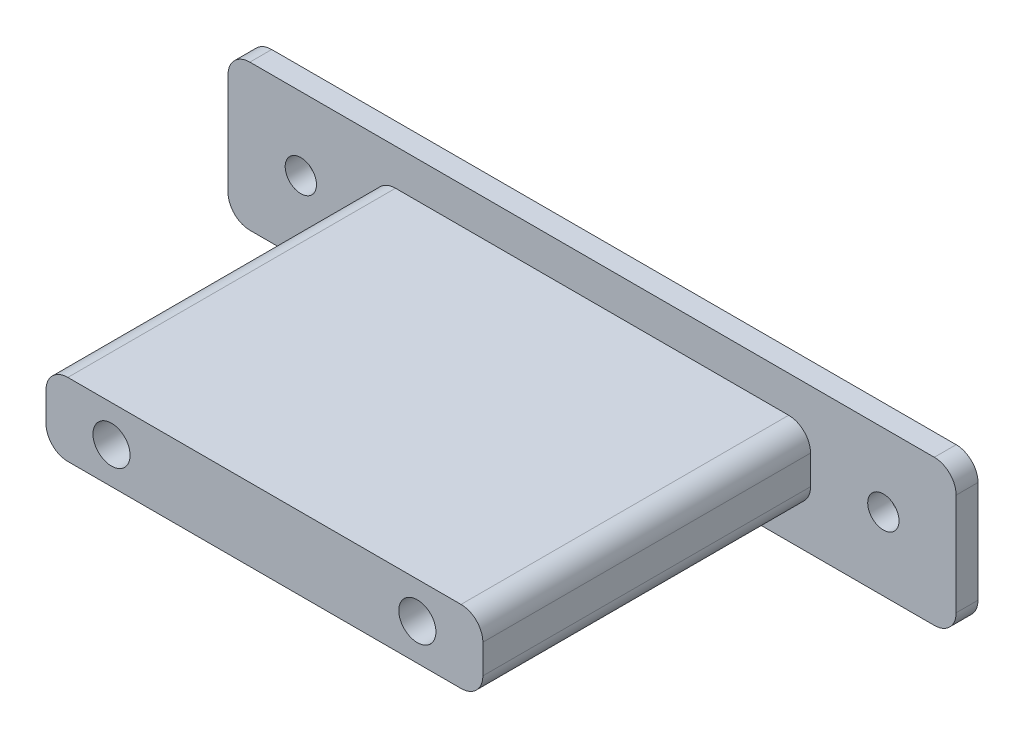
ISO-10303-21;
HEADER;
FILE_DESCRIPTION(('STEP AP214'),'2;1');
FILE_NAME('part.step','',(''),(''),'','','');
FILE_SCHEMA(('AUTOMOTIVE_DESIGN { 1 0 10303 214 1 1 1 1 }'));
ENDSEC;
DATA;
#1=APPLICATION_CONTEXT('core data for automotive mechanical design processes');
#2=APPLICATION_PROTOCOL_DEFINITION('international standard','automotive_design',2000,#1);
#3=PRODUCT_CONTEXT('',#1,'mechanical');
#4=PRODUCT('Part','Part','',(#3));
#5=PRODUCT_RELATED_PRODUCT_CATEGORY('part','',(#4));
#6=PRODUCT_DEFINITION_FORMATION('','',#4);
#7=PRODUCT_DEFINITION_CONTEXT('part definition',#1,'design');
#8=PRODUCT_DEFINITION('design','',#6,#7);
#9=PRODUCT_DEFINITION_SHAPE('','',#8);
#10=(LENGTH_UNIT() NAMED_UNIT(*) SI_UNIT(.MILLI.,.METRE.));
#11=(NAMED_UNIT(*) PLANE_ANGLE_UNIT() SI_UNIT($,.RADIAN.));
#12=(NAMED_UNIT(*) SI_UNIT($,.STERADIAN.) SOLID_ANGLE_UNIT());
#13=UNCERTAINTY_MEASURE_WITH_UNIT(LENGTH_MEASURE(1.E-05),#10,'distance_accuracy_value','');
#14=(GEOMETRIC_REPRESENTATION_CONTEXT(3) GLOBAL_UNCERTAINTY_ASSIGNED_CONTEXT((#13)) GLOBAL_UNIT_ASSIGNED_CONTEXT((#10,
#11,#12)) REPRESENTATION_CONTEXT('',''));
#15=CARTESIAN_POINT('',(0.,0.,0.));
#16=DIRECTION('',(0.,0.,1.));
#17=DIRECTION('',(1.,0.,0.));
#18=AXIS2_PLACEMENT_3D('',#15,#16,#17);
#19=CARTESIAN_POINT('',(0.,0.,3.));
#20=DIRECTION('',(0.,0.,1.));
#21=DIRECTION('',(1.,0.,0.));
#22=AXIS2_PLACEMENT_3D('',#19,#20,#21);
#23=PLANE('',#22);
#24=DIRECTION('',(1.,0.,0.));
#25=VECTOR('',#24,1.);
#26=CARTESIAN_POINT('',(0.,-5.,3.));
#27=LINE('',#26,#25);
#28=CARTESIAN_POINT('',(23.,-5.,3.));
#29=VERTEX_POINT('',#28);
#30=CARTESIAN_POINT('',(77.,-5.,3.));
#31=VERTEX_POINT('',#30);
#32=EDGE_CURVE('E255',#29,#31,#27,.T.);
#33=ORIENTED_EDGE('',*,*,#32,.T.);
#34=CARTESIAN_POINT('',(77.,-8.,3.));
#35=DIRECTION('',(0.,0.,1.));
#36=DIRECTION('',(1.,0.,0.));
#37=AXIS2_PLACEMENT_3D('',#34,#35,#36);
#38=CIRCLE('',#37,3.);
#39=CARTESIAN_POINT('',(80.,-8.,3.));
#40=VERTEX_POINT('',#39);
#41=EDGE_CURVE('E247',#31,#40,#38,.F.);
#42=ORIENTED_EDGE('',*,*,#41,.T.);
#43=DIRECTION('',(0.,-1.,0.));
#44=VECTOR('',#43,1.);
#45=CARTESIAN_POINT('',(80.,0.,3.));
#46=LINE('',#45,#44);
#47=CARTESIAN_POINT('',(80.,-12.,3.));
#48=VERTEX_POINT('',#47);
#49=EDGE_CURVE('E266',#40,#48,#46,.T.);
#50=ORIENTED_EDGE('',*,*,#49,.T.);
#51=CARTESIAN_POINT('',(77.,-12.,3.));
#52=DIRECTION('',(0.,0.,1.));
#53=DIRECTION('',(1.,0.,0.));
#54=AXIS2_PLACEMENT_3D('',#51,#52,#53);
#55=CIRCLE('',#54,3.);
#56=CARTESIAN_POINT('',(77.,-15.,3.));
#57=VERTEX_POINT('',#56);
#58=EDGE_CURVE('E249',#48,#57,#55,.F.);
#59=ORIENTED_EDGE('',*,*,#58,.T.);
#60=DIRECTION('',(1.,0.,0.));
#61=VECTOR('',#60,1.);
#62=CARTESIAN_POINT('',(0.,-15.,3.));
#63=LINE('',#62,#61);
#64=CARTESIAN_POINT('',(23.,-15.,3.));
#65=VERTEX_POINT('',#64);
#66=EDGE_CURVE('E290',#65,#57,#63,.T.);
#67=ORIENTED_EDGE('',*,*,#66,.F.);
#68=CARTESIAN_POINT('',(23.,-12.,3.));
#69=DIRECTION('',(0.,0.,1.));
#70=DIRECTION('',(1.,0.,0.));
#71=AXIS2_PLACEMENT_3D('',#68,#69,#70);
#72=CIRCLE('',#71,3.);
#73=CARTESIAN_POINT('',(20.,-12.,3.));
#74=VERTEX_POINT('',#73);
#75=EDGE_CURVE('E11',#65,#74,#72,.F.);
#76=ORIENTED_EDGE('',*,*,#75,.T.);
#77=DIRECTION('',(0.,-1.,0.));
#78=VECTOR('',#77,1.);
#79=CARTESIAN_POINT('',(20.,0.,3.));
#80=LINE('',#79,#78);
#81=CARTESIAN_POINT('',(20.,-8.,3.));
#82=VERTEX_POINT('',#81);
#83=EDGE_CURVE('E257',#82,#74,#80,.T.);
#84=ORIENTED_EDGE('',*,*,#83,.F.);
#85=CARTESIAN_POINT('',(23.,-8.,3.));
#86=DIRECTION('',(0.,0.,1.));
#87=DIRECTION('',(1.,0.,0.));
#88=AXIS2_PLACEMENT_3D('',#85,#86,#87);
#89=CIRCLE('',#88,3.);
#90=EDGE_CURVE('E45',#82,#29,#89,.F.);
#91=ORIENTED_EDGE('',*,*,#90,.T.);
#92=EDGE_LOOP('',(#33,#42,#50,#59,#67,#76,#84,#91));
#93=FACE_BOUND('',#92,.T.);
#94=CARTESIAN_POINT('',(10.,-10.,3.));
#95=DIRECTION('',(0.,0.,1.));
#96=DIRECTION('',(1.,0.,0.));
#97=AXIS2_PLACEMENT_3D('',#94,#95,#96);
#98=CIRCLE('',#97,2.15);
#99=CARTESIAN_POINT('',(12.15,-10.,3.));
#100=VERTEX_POINT('',#99);
#101=EDGE_CURVE('E179',#100,#100,#98,.T.);
#102=ORIENTED_EDGE('',*,*,#101,.F.);
#103=EDGE_LOOP('',(#102));
#104=FACE_BOUND('',#103,.T.);
#105=DIRECTION('',(-1.,0.,0.));
#106=VECTOR('',#105,1.);
#107=CARTESIAN_POINT('',(0.,0.,3.));
#108=LINE('',#107,#106);
#109=CARTESIAN_POINT('',(97.,0.,3.));
#110=VERTEX_POINT('',#109);
#111=CARTESIAN_POINT('',(3.,0.,3.));
#112=VERTEX_POINT('',#111);
#113=EDGE_CURVE('E188',#110,#112,#108,.T.);
#114=ORIENTED_EDGE('',*,*,#113,.T.);
#115=CARTESIAN_POINT('',(3.,-3.,3.));
#116=DIRECTION('',(0.,0.,1.));
#117=DIRECTION('',(1.,0.,0.));
#118=AXIS2_PLACEMENT_3D('',#115,#116,#117);
#119=CIRCLE('',#118,3.);
#120=CARTESIAN_POINT('',(0.,-3.,3.));
#121=VERTEX_POINT('',#120);
#122=EDGE_CURVE('E209',#112,#121,#119,.T.);
#123=ORIENTED_EDGE('',*,*,#122,.T.);
#124=DIRECTION('',(0.,-1.,0.));
#125=VECTOR('',#124,1.);
#126=CARTESIAN_POINT('',(0.,0.,3.));
#127=LINE('',#126,#125);
#128=CARTESIAN_POINT('',(0.,-17.,3.));
#129=VERTEX_POINT('',#128);
#130=EDGE_CURVE('E171',#121,#129,#127,.T.);
#131=ORIENTED_EDGE('',*,*,#130,.T.);
#132=CARTESIAN_POINT('',(3.,-17.,3.));
#133=DIRECTION('',(0.,0.,1.));
#134=DIRECTION('',(1.,0.,0.));
#135=AXIS2_PLACEMENT_3D('',#132,#133,#134);
#136=CIRCLE('',#135,3.);
#137=CARTESIAN_POINT('',(3.,-20.,3.));
#138=VERTEX_POINT('',#137);
#139=EDGE_CURVE('E203',#129,#138,#136,.T.);
#140=ORIENTED_EDGE('',*,*,#139,.T.);
#141=DIRECTION('',(1.,0.,0.));
#142=VECTOR('',#141,1.);
#143=CARTESIAN_POINT('',(0.,-20.,3.));
#144=LINE('',#143,#142);
#145=CARTESIAN_POINT('',(97.,-20.,3.));
#146=VERTEX_POINT('',#145);
#147=EDGE_CURVE('E300',#138,#146,#144,.T.);
#148=ORIENTED_EDGE('',*,*,#147,.T.);
#149=CARTESIAN_POINT('',(97.,-17.,3.));
#150=DIRECTION('',(0.,0.,1.));
#151=DIRECTION('',(1.,0.,0.));
#152=AXIS2_PLACEMENT_3D('',#149,#150,#151);
#153=CIRCLE('',#152,3.);
#154=CARTESIAN_POINT('',(100.,-17.,3.));
#155=VERTEX_POINT('',#154);
#156=EDGE_CURVE('E205',#146,#155,#153,.T.);
#157=ORIENTED_EDGE('',*,*,#156,.T.);
#158=DIRECTION('',(0.,1.,0.));
#159=VECTOR('',#158,1.);
#160=CARTESIAN_POINT('',(100.,0.,3.));
#161=LINE('',#160,#159);
#162=CARTESIAN_POINT('',(100.,-3.,3.));
#163=VERTEX_POINT('',#162);
#164=EDGE_CURVE('E302',#155,#163,#161,.T.);
#165=ORIENTED_EDGE('',*,*,#164,.T.);
#166=CARTESIAN_POINT('',(97.,-3.,3.));
#167=DIRECTION('',(0.,0.,1.));
#168=DIRECTION('',(1.,0.,0.));
#169=AXIS2_PLACEMENT_3D('',#166,#167,#168);
#170=CIRCLE('',#169,3.);
#171=EDGE_CURVE('E207',#163,#110,#170,.T.);
#172=ORIENTED_EDGE('',*,*,#171,.T.);
#173=EDGE_LOOP('',(#114,#123,#131,#140,#148,#157,#165,#172));
#174=FACE_BOUND('',#173,.T.);
#175=CARTESIAN_POINT('',(90.,-10.,3.));
#176=DIRECTION('',(0.,0.,1.));
#177=DIRECTION('',(-1.,0.,0.));
#178=AXIS2_PLACEMENT_3D('',#175,#176,#177);
#179=CIRCLE('',#178,2.15);
#180=CARTESIAN_POINT('',(87.85,-10.,3.));
#181=VERTEX_POINT('',#180);
#182=EDGE_CURVE('E292',#181,#181,#179,.T.);
#183=ORIENTED_EDGE('',*,*,#182,.F.);
#184=EDGE_LOOP('',(#183));
#185=FACE_BOUND('',#184,.T.);
#186=ADVANCED_FACE('F37',(#93,#104,#174,#185),#23,.T.);
#187=CARTESIAN_POINT('',(0.,0.,0.));
#188=DIRECTION('',(0.,0.,1.));
#189=DIRECTION('',(1.,0.,0.));
#190=AXIS2_PLACEMENT_3D('',#187,#188,#189);
#191=PLANE('',#190);
#192=DIRECTION('',(0.,-1.,0.));
#193=VECTOR('',#192,1.);
#194=CARTESIAN_POINT('',(0.,0.,0.));
#195=LINE('',#194,#193);
#196=CARTESIAN_POINT('',(0.,-3.,0.));
#197=VERTEX_POINT('',#196);
#198=CARTESIAN_POINT('',(0.,-17.,0.));
#199=VERTEX_POINT('',#198);
#200=EDGE_CURVE('E168',#197,#199,#195,.T.);
#201=ORIENTED_EDGE('',*,*,#200,.F.);
#202=CARTESIAN_POINT('',(3.,-3.,0.));
#203=DIRECTION('',(0.,0.,1.));
#204=DIRECTION('',(1.,0.,0.));
#205=AXIS2_PLACEMENT_3D('',#202,#203,#204);
#206=CIRCLE('',#205,3.);
#207=CARTESIAN_POINT('',(3.,0.,0.));
#208=VERTEX_POINT('',#207);
#209=EDGE_CURVE('E151',#197,#208,#206,.F.);
#210=ORIENTED_EDGE('',*,*,#209,.T.);
#211=DIRECTION('',(-1.,0.,0.));
#212=VECTOR('',#211,1.);
#213=CARTESIAN_POINT('',(0.,0.,0.));
#214=LINE('',#213,#212);
#215=CARTESIAN_POINT('',(97.,0.,0.));
#216=VERTEX_POINT('',#215);
#217=EDGE_CURVE('E193',#216,#208,#214,.T.);
#218=ORIENTED_EDGE('',*,*,#217,.F.);
#219=CARTESIAN_POINT('',(97.,-3.,0.));
#220=DIRECTION('',(0.,0.,1.));
#221=DIRECTION('',(1.,0.,0.));
#222=AXIS2_PLACEMENT_3D('',#219,#220,#221);
#223=CIRCLE('',#222,3.);
#224=CARTESIAN_POINT('',(100.,-3.,0.));
#225=VERTEX_POINT('',#224);
#226=EDGE_CURVE('E162',#216,#225,#223,.F.);
#227=ORIENTED_EDGE('',*,*,#226,.T.);
#228=DIRECTION('',(0.,1.,0.));
#229=VECTOR('',#228,1.);
#230=CARTESIAN_POINT('',(100.,0.,0.));
#231=LINE('',#230,#229);
#232=CARTESIAN_POINT('',(100.,-17.,0.));
#233=VERTEX_POINT('',#232);
#234=EDGE_CURVE('E182',#233,#225,#231,.T.);
#235=ORIENTED_EDGE('',*,*,#234,.F.);
#236=CARTESIAN_POINT('',(97.,-17.,0.));
#237=DIRECTION('',(0.,0.,1.));
#238=DIRECTION('',(1.,0.,0.));
#239=AXIS2_PLACEMENT_3D('',#236,#237,#238);
#240=CIRCLE('',#239,3.);
#241=CARTESIAN_POINT('',(97.,-20.,0.));
#242=VERTEX_POINT('',#241);
#243=EDGE_CURVE('E197',#233,#242,#240,.F.);
#244=ORIENTED_EDGE('',*,*,#243,.T.);
#245=DIRECTION('',(1.,0.,0.));
#246=VECTOR('',#245,1.);
#247=CARTESIAN_POINT('',(0.,-20.,0.));
#248=LINE('',#247,#246);
#249=CARTESIAN_POINT('',(3.,-20.,0.));
#250=VERTEX_POINT('',#249);
#251=EDGE_CURVE('E178',#250,#242,#248,.T.);
#252=ORIENTED_EDGE('',*,*,#251,.F.);
#253=CARTESIAN_POINT('',(3.,-17.,0.));
#254=DIRECTION('',(0.,0.,1.));
#255=DIRECTION('',(1.,0.,0.));
#256=AXIS2_PLACEMENT_3D('',#253,#254,#255);
#257=CIRCLE('',#256,3.);
#258=EDGE_CURVE('E172',#250,#199,#257,.F.);
#259=ORIENTED_EDGE('',*,*,#258,.T.);
#260=EDGE_LOOP('',(#201,#210,#218,#227,#235,#244,#252,#259));
#261=FACE_BOUND('',#260,.T.);
#262=CARTESIAN_POINT('',(10.,-10.,0.));
#263=DIRECTION('',(0.,0.,1.));
#264=DIRECTION('',(1.,0.,0.));
#265=AXIS2_PLACEMENT_3D('',#262,#263,#264);
#266=CIRCLE('',#265,2.15);
#267=CARTESIAN_POINT('',(12.15,-10.,0.));
#268=VERTEX_POINT('',#267);
#269=EDGE_CURVE('E185',#268,#268,#266,.T.);
#270=ORIENTED_EDGE('',*,*,#269,.T.);
#271=EDGE_LOOP('',(#270));
#272=FACE_BOUND('',#271,.T.);
#273=CARTESIAN_POINT('',(90.,-10.,0.));
#274=DIRECTION('',(0.,0.,1.));
#275=DIRECTION('',(-1.,0.,0.));
#276=AXIS2_PLACEMENT_3D('',#273,#274,#275);
#277=CIRCLE('',#276,2.15);
#278=CARTESIAN_POINT('',(87.85,-10.,0.));
#279=VERTEX_POINT('',#278);
#280=EDGE_CURVE('E280',#279,#279,#277,.T.);
#281=ORIENTED_EDGE('',*,*,#280,.T.);
#282=EDGE_LOOP('',(#281));
#283=FACE_BOUND('',#282,.T.);
#284=ADVANCED_FACE('F175',(#261,#272,#283),#191,.F.);
#285=CARTESIAN_POINT('',(0.,0.,3.));
#286=DIRECTION('',(1.,0.,0.));
#287=DIRECTION('',(0.,1.,0.));
#288=AXIS2_PLACEMENT_3D('',#285,#286,#287);
#289=PLANE('',#288);
#290=ORIENTED_EDGE('',*,*,#130,.F.);
#291=DIRECTION('',(0.,0.,-1.));
#292=VECTOR('',#291,1.);
#293=CARTESIAN_POINT('',(0.,-3.,3.));
#294=LINE('',#293,#292);
#295=EDGE_CURVE('E155',#121,#197,#294,.T.);
#296=ORIENTED_EDGE('',*,*,#295,.T.);
#297=ORIENTED_EDGE('',*,*,#200,.T.);
#298=DIRECTION('',(0.,0.,-1.));
#299=VECTOR('',#298,1.);
#300=CARTESIAN_POINT('',(0.,-17.,3.));
#301=LINE('',#300,#299);
#302=EDGE_CURVE('E173',#199,#129,#301,.F.);
#303=ORIENTED_EDGE('',*,*,#302,.T.);
#304=EDGE_LOOP('',(#290,#296,#297,#303));
#305=FACE_BOUND('',#304,.T.);
#306=ADVANCED_FACE('F167',(#305),#289,.F.);
#307=CARTESIAN_POINT('',(0.,-20.,3.));
#308=DIRECTION('',(0.,1.,0.));
#309=DIRECTION('',(0.,0.,1.));
#310=AXIS2_PLACEMENT_3D('',#307,#308,#309);
#311=PLANE('',#310);
#312=ORIENTED_EDGE('',*,*,#251,.T.);
#313=DIRECTION('',(0.,0.,-1.));
#314=VECTOR('',#313,1.);
#315=CARTESIAN_POINT('',(97.,-20.,3.));
#316=LINE('',#315,#314);
#317=EDGE_CURVE('E219',#242,#146,#316,.F.);
#318=ORIENTED_EDGE('',*,*,#317,.T.);
#319=ORIENTED_EDGE('',*,*,#147,.F.);
#320=DIRECTION('',(0.,0.,-1.));
#321=VECTOR('',#320,1.);
#322=CARTESIAN_POINT('',(3.,-20.,3.));
#323=LINE('',#322,#321);
#324=EDGE_CURVE('E216',#138,#250,#323,.T.);
#325=ORIENTED_EDGE('',*,*,#324,.T.);
#326=EDGE_LOOP('',(#312,#318,#319,#325));
#327=FACE_BOUND('',#326,.T.);
#328=ADVANCED_FACE('F325',(#327),#311,.F.);
#329=CARTESIAN_POINT('',(100.,0.,3.));
#330=DIRECTION('',(-1.,0.,0.));
#331=DIRECTION('',(0.,0.,1.));
#332=AXIS2_PLACEMENT_3D('',#329,#330,#331);
#333=PLANE('',#332);
#334=ORIENTED_EDGE('',*,*,#234,.T.);
#335=DIRECTION('',(0.,0.,-1.));
#336=VECTOR('',#335,1.);
#337=CARTESIAN_POINT('',(100.,-3.,3.));
#338=LINE('',#337,#336);
#339=EDGE_CURVE('E214',#225,#163,#338,.F.);
#340=ORIENTED_EDGE('',*,*,#339,.T.);
#341=ORIENTED_EDGE('',*,*,#164,.F.);
#342=DIRECTION('',(0.,0.,-1.));
#343=VECTOR('',#342,1.);
#344=CARTESIAN_POINT('',(100.,-17.,3.));
#345=LINE('',#344,#343);
#346=EDGE_CURVE('E211',#155,#233,#345,.T.);
#347=ORIENTED_EDGE('',*,*,#346,.T.);
#348=EDGE_LOOP('',(#334,#340,#341,#347));
#349=FACE_BOUND('',#348,.T.);
#350=ADVANCED_FACE('F318',(#349),#333,.F.);
#351=CARTESIAN_POINT('',(0.,0.,3.));
#352=DIRECTION('',(0.,-1.,0.));
#353=DIRECTION('',(0.,0.,-1.));
#354=AXIS2_PLACEMENT_3D('',#351,#352,#353);
#355=PLANE('',#354);
#356=ORIENTED_EDGE('',*,*,#217,.T.);
#357=DIRECTION('',(0.,0.,-1.));
#358=VECTOR('',#357,1.);
#359=CARTESIAN_POINT('',(3.,0.,3.));
#360=LINE('',#359,#358);
#361=EDGE_CURVE('E156',#208,#112,#360,.F.);
#362=ORIENTED_EDGE('',*,*,#361,.T.);
#363=ORIENTED_EDGE('',*,*,#113,.F.);
#364=DIRECTION('',(0.,0.,-1.));
#365=VECTOR('',#364,1.);
#366=CARTESIAN_POINT('',(97.,0.,3.));
#367=LINE('',#366,#365);
#368=EDGE_CURVE('E161',#110,#216,#367,.T.);
#369=ORIENTED_EDGE('',*,*,#368,.T.);
#370=EDGE_LOOP('',(#356,#362,#363,#369));
#371=FACE_BOUND('',#370,.T.);
#372=ADVANCED_FACE('F312',(#371),#355,.F.);
#373=CARTESIAN_POINT('',(10.,-10.,3.));
#374=DIRECTION('',(0.,0.,-1.));
#375=DIRECTION('',(-1.,0.,0.));
#376=AXIS2_PLACEMENT_3D('',#373,#374,#375);
#377=CYLINDRICAL_SURFACE('',#376,2.15);
#378=ORIENTED_EDGE('',*,*,#101,.T.);
#379=EDGE_LOOP('',(#378));
#380=FACE_BOUND('',#379,.T.);
#381=ORIENTED_EDGE('',*,*,#269,.F.);
#382=EDGE_LOOP('',(#381));
#383=FACE_BOUND('',#382,.T.);
#384=ADVANCED_FACE('F349',(#380,#383),#377,.F.);
#385=CARTESIAN_POINT('',(90.,-10.,3.));
#386=DIRECTION('',(0.,0.,-1.));
#387=DIRECTION('',(-1.,0.,0.));
#388=AXIS2_PLACEMENT_3D('',#385,#386,#387);
#389=CYLINDRICAL_SURFACE('',#388,2.15);
#390=ORIENTED_EDGE('',*,*,#182,.T.);
#391=EDGE_LOOP('',(#390));
#392=FACE_BOUND('',#391,.T.);
#393=ORIENTED_EDGE('',*,*,#280,.F.);
#394=EDGE_LOOP('',(#393));
#395=FACE_BOUND('',#394,.T.);
#396=ADVANCED_FACE('F467',(#392,#395),#389,.F.);
#397=CARTESIAN_POINT('',(80.,0.,48.));
#398=DIRECTION('',(1.,0.,0.));
#399=DIRECTION('',(0.,0.,-1.));
#400=AXIS2_PLACEMENT_3D('',#397,#398,#399);
#401=PLANE('',#400);
#402=ORIENTED_EDGE('',*,*,#49,.F.);
#403=DIRECTION('',(0.,0.,-1.));
#404=VECTOR('',#403,1.);
#405=CARTESIAN_POINT('',(80.,-8.,48.));
#406=LINE('',#405,#404);
#407=CARTESIAN_POINT('',(80.,-8.,48.));
#408=VERTEX_POINT('',#407);
#409=EDGE_CURVE('E229',#40,#408,#406,.F.);
#410=ORIENTED_EDGE('',*,*,#409,.T.);
#411=DIRECTION('',(0.,-1.,0.));
#412=VECTOR('',#411,1.);
#413=CARTESIAN_POINT('',(80.,0.,48.));
#414=LINE('',#413,#412);
#415=CARTESIAN_POINT('',(80.,-12.,48.));
#416=VERTEX_POINT('',#415);
#417=EDGE_CURVE('E282',#408,#416,#414,.T.);
#418=ORIENTED_EDGE('',*,*,#417,.T.);
#419=DIRECTION('',(0.,0.,-1.));
#420=VECTOR('',#419,1.);
#421=CARTESIAN_POINT('',(80.,-12.,3.));
#422=LINE('',#421,#420);
#423=EDGE_CURVE('E226',#416,#48,#422,.T.);
#424=ORIENTED_EDGE('',*,*,#423,.T.);
#425=EDGE_LOOP('',(#402,#410,#418,#424));
#426=FACE_BOUND('',#425,.T.);
#427=ADVANCED_FACE('F419',(#426),#401,.T.);
#428=CARTESIAN_POINT('',(0.,-5.,48.));
#429=DIRECTION('',(0.,1.,0.));
#430=DIRECTION('',(-1.,0.,0.));
#431=AXIS2_PLACEMENT_3D('',#428,#429,#430);
#432=PLANE('',#431);
#433=DIRECTION('',(1.,0.,0.));
#434=VECTOR('',#433,1.);
#435=CARTESIAN_POINT('',(0.,-5.,48.));
#436=LINE('',#435,#434);
#437=CARTESIAN_POINT('',(23.,-5.,48.));
#438=VERTEX_POINT('',#437);
#439=CARTESIAN_POINT('',(77.,-5.,48.));
#440=VERTEX_POINT('',#439);
#441=EDGE_CURVE('E274',#438,#440,#436,.T.);
#442=ORIENTED_EDGE('',*,*,#441,.T.);
#443=DIRECTION('',(0.,0.,-1.));
#444=VECTOR('',#443,1.);
#445=CARTESIAN_POINT('',(77.,-5.,48.));
#446=LINE('',#445,#444);
#447=EDGE_CURVE('E223',#440,#31,#446,.T.);
#448=ORIENTED_EDGE('',*,*,#447,.T.);
#449=ORIENTED_EDGE('',*,*,#32,.F.);
#450=DIRECTION('',(0.,0.,-1.));
#451=VECTOR('',#450,1.);
#452=CARTESIAN_POINT('',(23.,-5.,48.));
#453=LINE('',#452,#451);
#454=EDGE_CURVE('E221',#29,#438,#453,.F.);
#455=ORIENTED_EDGE('',*,*,#454,.T.);
#456=EDGE_LOOP('',(#442,#448,#449,#455));
#457=FACE_BOUND('',#456,.T.);
#458=ADVANCED_FACE('F263',(#457),#432,.T.);
#459=CARTESIAN_POINT('',(20.,0.,48.));
#460=DIRECTION('',(1.,0.,0.));
#461=DIRECTION('',(0.,1.,0.));
#462=AXIS2_PLACEMENT_3D('',#459,#460,#461);
#463=PLANE('',#462);
#464=DIRECTION('',(0.,-1.,0.));
#465=VECTOR('',#464,1.);
#466=CARTESIAN_POINT('',(20.,0.,48.));
#467=LINE('',#466,#465);
#468=CARTESIAN_POINT('',(20.,-8.,48.));
#469=VERTEX_POINT('',#468);
#470=CARTESIAN_POINT('',(20.,-12.,48.));
#471=VERTEX_POINT('',#470);
#472=EDGE_CURVE('E273',#469,#471,#467,.T.);
#473=ORIENTED_EDGE('',*,*,#472,.F.);
#474=DIRECTION('',(0.,0.,-1.));
#475=VECTOR('',#474,1.);
#476=CARTESIAN_POINT('',(20.,-8.,3.));
#477=LINE('',#476,#475);
#478=EDGE_CURVE('E244',#469,#82,#477,.T.);
#479=ORIENTED_EDGE('',*,*,#478,.T.);
#480=ORIENTED_EDGE('',*,*,#83,.T.);
#481=DIRECTION('',(0.,0.,-1.));
#482=VECTOR('',#481,1.);
#483=CARTESIAN_POINT('',(20.,-12.,48.));
#484=LINE('',#483,#482);
#485=EDGE_CURVE('E242',#74,#471,#484,.F.);
#486=ORIENTED_EDGE('',*,*,#485,.T.);
#487=EDGE_LOOP('',(#473,#479,#480,#486));
#488=FACE_BOUND('',#487,.T.);
#489=ADVANCED_FACE('F276',(#488),#463,.F.);
#490=CARTESIAN_POINT('',(0.,-15.,48.));
#491=DIRECTION('',(0.,1.,0.));
#492=DIRECTION('',(-1.,0.,0.));
#493=AXIS2_PLACEMENT_3D('',#490,#491,#492);
#494=PLANE('',#493);
#495=ORIENTED_EDGE('',*,*,#66,.T.);
#496=DIRECTION('',(0.,0.,-1.));
#497=VECTOR('',#496,1.);
#498=CARTESIAN_POINT('',(77.,-15.,48.));
#499=LINE('',#498,#497);
#500=CARTESIAN_POINT('',(77.,-15.,48.));
#501=VERTEX_POINT('',#500);
#502=EDGE_CURVE('E52',#57,#501,#499,.F.);
#503=ORIENTED_EDGE('',*,*,#502,.T.);
#504=DIRECTION('',(1.,0.,0.));
#505=VECTOR('',#504,1.);
#506=CARTESIAN_POINT('',(0.,-15.,48.));
#507=LINE('',#506,#505);
#508=CARTESIAN_POINT('',(23.,-15.,48.));
#509=VERTEX_POINT('',#508);
#510=EDGE_CURVE('E278',#509,#501,#507,.T.);
#511=ORIENTED_EDGE('',*,*,#510,.F.);
#512=DIRECTION('',(0.,0.,-1.));
#513=VECTOR('',#512,1.);
#514=CARTESIAN_POINT('',(23.,-15.,48.));
#515=LINE('',#514,#513);
#516=EDGE_CURVE('E238',#509,#65,#515,.T.);
#517=ORIENTED_EDGE('',*,*,#516,.T.);
#518=EDGE_LOOP('',(#495,#503,#511,#517));
#519=FACE_BOUND('',#518,.T.);
#520=ADVANCED_FACE('F413',(#519),#494,.F.);
#521=CARTESIAN_POINT('',(0.,0.,48.));
#522=DIRECTION('',(0.,0.,1.));
#523=DIRECTION('',(1.,0.,0.));
#524=AXIS2_PLACEMENT_3D('',#521,#522,#523);
#525=PLANE('',#524);
#526=CARTESIAN_POINT('',(71.,-10.,48.));
#527=DIRECTION('',(0.,0.,1.));
#528=DIRECTION('',(1.,0.,0.));
#529=AXIS2_PLACEMENT_3D('',#526,#527,#528);
#530=CIRCLE('',#529,2.54999999999999);
#531=CARTESIAN_POINT('',(73.55,-10.,48.));
#532=VERTEX_POINT('',#531);
#533=EDGE_CURVE('E429',#532,#532,#530,.T.);
#534=ORIENTED_EDGE('',*,*,#533,.F.);
#535=EDGE_LOOP('',(#534));
#536=FACE_BOUND('',#535,.T.);
#537=CARTESIAN_POINT('',(29.,-10.,48.));
#538=DIRECTION('',(0.,0.,1.));
#539=DIRECTION('',(1.,0.,0.));
#540=AXIS2_PLACEMENT_3D('',#537,#538,#539);
#541=CIRCLE('',#540,2.55);
#542=CARTESIAN_POINT('',(31.55,-10.,48.));
#543=VERTEX_POINT('',#542);
#544=EDGE_CURVE('E426',#543,#543,#541,.T.);
#545=ORIENTED_EDGE('',*,*,#544,.F.);
#546=EDGE_LOOP('',(#545));
#547=FACE_BOUND('',#546,.T.);
#548=ORIENTED_EDGE('',*,*,#417,.F.);
#549=CARTESIAN_POINT('',(77.,-8.,48.));
#550=DIRECTION('',(0.,0.,1.));
#551=DIRECTION('',(1.,0.,0.));
#552=AXIS2_PLACEMENT_3D('',#549,#550,#551);
#553=CIRCLE('',#552,3.);
#554=EDGE_CURVE('E236',#408,#440,#553,.T.);
#555=ORIENTED_EDGE('',*,*,#554,.T.);
#556=ORIENTED_EDGE('',*,*,#441,.F.);
#557=CARTESIAN_POINT('',(23.,-8.,48.));
#558=DIRECTION('',(0.,0.,1.));
#559=DIRECTION('',(1.,0.,0.));
#560=AXIS2_PLACEMENT_3D('',#557,#558,#559);
#561=CIRCLE('',#560,3.);
#562=EDGE_CURVE('E232',#438,#469,#561,.T.);
#563=ORIENTED_EDGE('',*,*,#562,.T.);
#564=ORIENTED_EDGE('',*,*,#472,.T.);
#565=CARTESIAN_POINT('',(23.,-12.,48.));
#566=DIRECTION('',(0.,0.,1.));
#567=DIRECTION('',(1.,0.,0.));
#568=AXIS2_PLACEMENT_3D('',#565,#566,#567);
#569=CIRCLE('',#568,3.);
#570=EDGE_CURVE('E59',#471,#509,#569,.T.);
#571=ORIENTED_EDGE('',*,*,#570,.T.);
#572=ORIENTED_EDGE('',*,*,#510,.T.);
#573=CARTESIAN_POINT('',(77.,-12.,48.));
#574=DIRECTION('',(0.,0.,1.));
#575=DIRECTION('',(1.,0.,0.));
#576=AXIS2_PLACEMENT_3D('',#573,#574,#575);
#577=CIRCLE('',#576,3.);
#578=EDGE_CURVE('E234',#501,#416,#577,.T.);
#579=ORIENTED_EDGE('',*,*,#578,.T.);
#580=EDGE_LOOP('',(#548,#555,#556,#563,#564,#571,#572,#579));
#581=FACE_BOUND('',#580,.T.);
#582=ADVANCED_FACE('F272',(#536,#547,#581),#525,.T.);
#583=CARTESIAN_POINT('',(29.,-10.,40.));
#584=DIRECTION('',(0.,0.,1.));
#585=DIRECTION('',(1.,0.,0.));
#586=AXIS2_PLACEMENT_3D('',#583,#584,#585);
#587=CYLINDRICAL_SURFACE('',#586,2.55);
#588=CARTESIAN_POINT('',(29.,-10.,40.));
#589=DIRECTION('',(0.,0.,1.));
#590=DIRECTION('',(1.,0.,0.));
#591=AXIS2_PLACEMENT_3D('',#588,#589,#590);
#592=CIRCLE('',#591,2.55);
#593=CARTESIAN_POINT('',(31.55,-10.,40.));
#594=VERTEX_POINT('',#593);
#595=EDGE_CURVE('E423',#594,#594,#592,.T.);
#596=ORIENTED_EDGE('',*,*,#595,.F.);
#597=EDGE_LOOP('',(#596));
#598=FACE_BOUND('',#597,.T.);
#599=ORIENTED_EDGE('',*,*,#544,.T.);
#600=EDGE_LOOP('',(#599));
#601=FACE_BOUND('',#600,.T.);
#602=ADVANCED_FACE('F445',(#598,#601),#587,.F.);
#603=CARTESIAN_POINT('',(29.,-10.,40.));
#604=DIRECTION('',(0.,0.,1.));
#605=DIRECTION('',(1.,0.,0.));
#606=AXIS2_PLACEMENT_3D('',#603,#604,#605);
#607=PLANE('',#606);
#608=ORIENTED_EDGE('',*,*,#595,.T.);
#609=EDGE_LOOP('',(#608));
#610=FACE_BOUND('',#609,.T.);
#611=ADVANCED_FACE('F439',(#610),#607,.T.);
#612=CARTESIAN_POINT('',(71.,-10.,40.));
#613=DIRECTION('',(0.,0.,1.));
#614=DIRECTION('',(1.,0.,0.));
#615=AXIS2_PLACEMENT_3D('',#612,#613,#614);
#616=CYLINDRICAL_SURFACE('',#615,2.54999999999999);
#617=CARTESIAN_POINT('',(71.,-10.,40.));
#618=DIRECTION('',(0.,0.,1.));
#619=DIRECTION('',(1.,0.,0.));
#620=AXIS2_PLACEMENT_3D('',#617,#618,#619);
#621=CIRCLE('',#620,2.54999999999999);
#622=CARTESIAN_POINT('',(73.55,-10.,40.));
#623=VERTEX_POINT('',#622);
#624=EDGE_CURVE('E287',#623,#623,#621,.T.);
#625=ORIENTED_EDGE('',*,*,#624,.F.);
#626=EDGE_LOOP('',(#625));
#627=FACE_BOUND('',#626,.T.);
#628=ORIENTED_EDGE('',*,*,#533,.T.);
#629=EDGE_LOOP('',(#628));
#630=FACE_BOUND('',#629,.T.);
#631=ADVANCED_FACE('F436',(#627,#630),#616,.F.);
#632=CARTESIAN_POINT('',(71.,-10.,40.));
#633=DIRECTION('',(0.,0.,1.));
#634=DIRECTION('',(1.,0.,0.));
#635=AXIS2_PLACEMENT_3D('',#632,#633,#634);
#636=PLANE('',#635);
#637=ORIENTED_EDGE('',*,*,#624,.T.);
#638=EDGE_LOOP('',(#637));
#639=FACE_BOUND('',#638,.T.);
#640=ADVANCED_FACE('F362',(#639),#636,.T.);
#641=CARTESIAN_POINT('',(3.,-3.,3.));
#642=DIRECTION('',(0.,0.,-1.));
#643=DIRECTION('',(-1.,0.,0.));
#644=AXIS2_PLACEMENT_3D('',#641,#642,#643);
#645=CYLINDRICAL_SURFACE('',#644,3.);
#646=ORIENTED_EDGE('',*,*,#122,.F.);
#647=ORIENTED_EDGE('',*,*,#361,.F.);
#648=ORIENTED_EDGE('',*,*,#209,.F.);
#649=ORIENTED_EDGE('',*,*,#295,.F.);
#650=EDGE_LOOP('',(#646,#647,#648,#649));
#651=FACE_BOUND('',#650,.T.);
#652=ADVANCED_FACE('F154',(#651),#645,.T.);
#653=CARTESIAN_POINT('',(97.,-3.,3.));
#654=DIRECTION('',(0.,0.,-1.));
#655=DIRECTION('',(-1.,0.,0.));
#656=AXIS2_PLACEMENT_3D('',#653,#654,#655);
#657=CYLINDRICAL_SURFACE('',#656,3.);
#658=ORIENTED_EDGE('',*,*,#171,.F.);
#659=ORIENTED_EDGE('',*,*,#339,.F.);
#660=ORIENTED_EDGE('',*,*,#226,.F.);
#661=ORIENTED_EDGE('',*,*,#368,.F.);
#662=EDGE_LOOP('',(#658,#659,#660,#661));
#663=FACE_BOUND('',#662,.T.);
#664=ADVANCED_FACE('F314',(#663),#657,.T.);
#665=CARTESIAN_POINT('',(97.,-17.,3.));
#666=DIRECTION('',(0.,0.,-1.));
#667=DIRECTION('',(-1.,0.,0.));
#668=AXIS2_PLACEMENT_3D('',#665,#666,#667);
#669=CYLINDRICAL_SURFACE('',#668,3.);
#670=ORIENTED_EDGE('',*,*,#156,.F.);
#671=ORIENTED_EDGE('',*,*,#317,.F.);
#672=ORIENTED_EDGE('',*,*,#243,.F.);
#673=ORIENTED_EDGE('',*,*,#346,.F.);
#674=EDGE_LOOP('',(#670,#671,#672,#673));
#675=FACE_BOUND('',#674,.T.);
#676=ADVANCED_FACE('F322',(#675),#669,.T.);
#677=CARTESIAN_POINT('',(3.,-17.,3.));
#678=DIRECTION('',(0.,0.,-1.));
#679=DIRECTION('',(-1.,0.,0.));
#680=AXIS2_PLACEMENT_3D('',#677,#678,#679);
#681=CYLINDRICAL_SURFACE('',#680,3.);
#682=ORIENTED_EDGE('',*,*,#139,.F.);
#683=ORIENTED_EDGE('',*,*,#302,.F.);
#684=ORIENTED_EDGE('',*,*,#258,.F.);
#685=ORIENTED_EDGE('',*,*,#324,.F.);
#686=EDGE_LOOP('',(#682,#683,#684,#685));
#687=FACE_BOUND('',#686,.T.);
#688=ADVANCED_FACE('F330',(#687),#681,.T.);
#689=CARTESIAN_POINT('',(77.,-8.,48.));
#690=DIRECTION('',(0.,0.,-1.));
#691=DIRECTION('',(-1.,0.,0.));
#692=AXIS2_PLACEMENT_3D('',#689,#690,#691);
#693=CYLINDRICAL_SURFACE('',#692,3.);
#694=ORIENTED_EDGE('',*,*,#554,.F.);
#695=ORIENTED_EDGE('',*,*,#409,.F.);
#696=ORIENTED_EDGE('',*,*,#41,.F.);
#697=ORIENTED_EDGE('',*,*,#447,.F.);
#698=EDGE_LOOP('',(#694,#695,#696,#697));
#699=FACE_BOUND('',#698,.T.);
#700=ADVANCED_FACE('F332',(#699),#693,.T.);
#701=CARTESIAN_POINT('',(77.,-12.,48.));
#702=DIRECTION('',(0.,0.,1.));
#703=DIRECTION('',(1.,0.,0.));
#704=AXIS2_PLACEMENT_3D('',#701,#702,#703);
#705=CYLINDRICAL_SURFACE('',#704,3.);
#706=ORIENTED_EDGE('',*,*,#578,.F.);
#707=ORIENTED_EDGE('',*,*,#502,.F.);
#708=ORIENTED_EDGE('',*,*,#58,.F.);
#709=ORIENTED_EDGE('',*,*,#423,.F.);
#710=EDGE_LOOP('',(#706,#707,#708,#709));
#711=FACE_BOUND('',#710,.T.);
#712=ADVANCED_FACE('F338',(#711),#705,.T.);
#713=CARTESIAN_POINT('',(23.,-8.,48.));
#714=DIRECTION('',(0.,0.,1.));
#715=DIRECTION('',(1.,0.,0.));
#716=AXIS2_PLACEMENT_3D('',#713,#714,#715);
#717=CYLINDRICAL_SURFACE('',#716,3.);
#718=ORIENTED_EDGE('',*,*,#562,.F.);
#719=ORIENTED_EDGE('',*,*,#454,.F.);
#720=ORIENTED_EDGE('',*,*,#90,.F.);
#721=ORIENTED_EDGE('',*,*,#478,.F.);
#722=EDGE_LOOP('',(#718,#719,#720,#721));
#723=FACE_BOUND('',#722,.T.);
#724=ADVANCED_FACE('F269',(#723),#717,.T.);
#725=CARTESIAN_POINT('',(23.,-12.,48.));
#726=DIRECTION('',(0.,0.,-1.));
#727=DIRECTION('',(-1.,0.,0.));
#728=AXIS2_PLACEMENT_3D('',#725,#726,#727);
#729=CYLINDRICAL_SURFACE('',#728,3.);
#730=ORIENTED_EDGE('',*,*,#570,.F.);
#731=ORIENTED_EDGE('',*,*,#485,.F.);
#732=ORIENTED_EDGE('',*,*,#75,.F.);
#733=ORIENTED_EDGE('',*,*,#516,.F.);
#734=EDGE_LOOP('',(#730,#731,#732,#733));
#735=FACE_BOUND('',#734,.T.);
#736=ADVANCED_FACE('F39',(#735),#729,.T.);
#737=CLOSED_SHELL('',(#186,#284,#306,#328,#350,#372,#384,#396,#427,#458,#489,#520,#582,#602,
#611,#631,#640,#652,#664,#676,#688,#700,#712,#724,#736));
#738=MANIFOLD_SOLID_BREP('B2',#737);
#739=ADVANCED_BREP_SHAPE_REPRESENTATION('',(#18,#738),#14);
#740=SHAPE_DEFINITION_REPRESENTATION(#9,#739);
ENDSEC;
END-ISO-10303-21;
